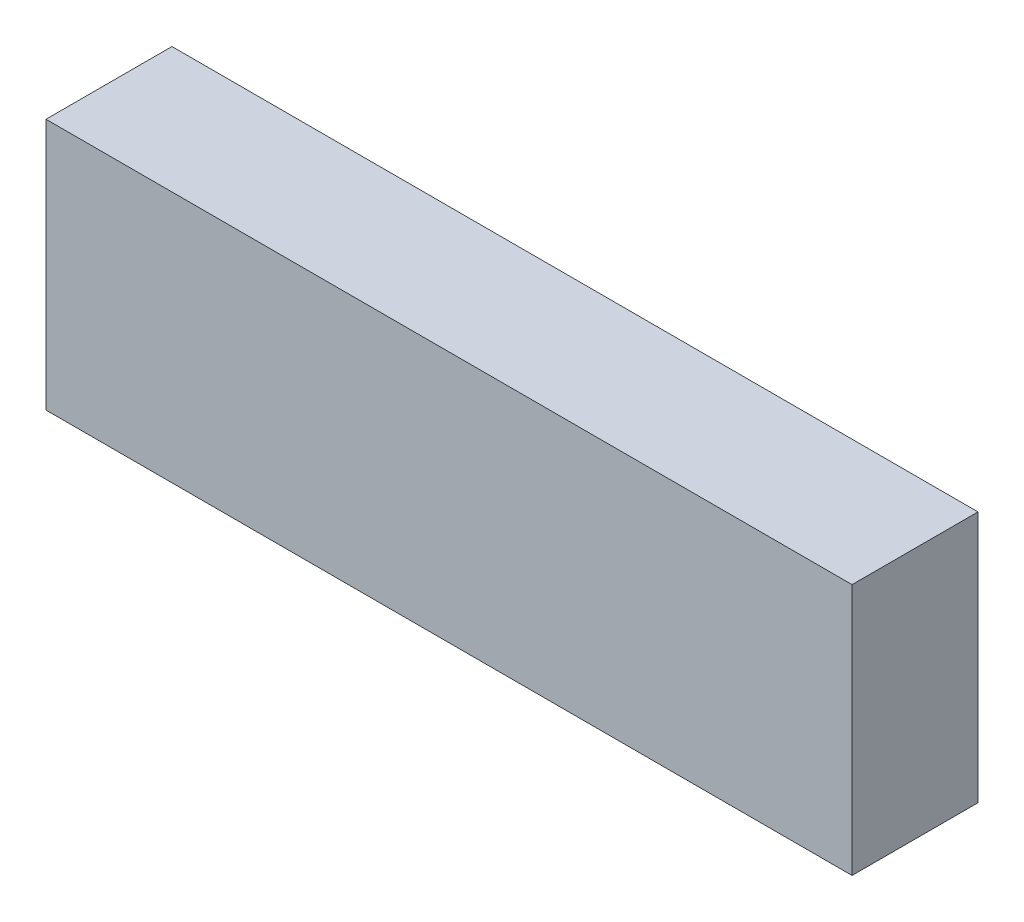
ISO-10303-21;
HEADER;
FILE_DESCRIPTION(('STEP AP214'),'2;1');
FILE_NAME('part.step','',(''),(''),'','','');
FILE_SCHEMA(('AUTOMOTIVE_DESIGN { 1 0 10303 214 1 1 1 1 }'));
ENDSEC;
DATA;
#1=APPLICATION_CONTEXT('core data for automotive mechanical design processes');
#2=APPLICATION_PROTOCOL_DEFINITION('international standard','automotive_design',2000,#1);
#3=PRODUCT_CONTEXT('',#1,'mechanical');
#4=PRODUCT('Part','Part','',(#3));
#5=PRODUCT_RELATED_PRODUCT_CATEGORY('part','',(#4));
#6=PRODUCT_DEFINITION_FORMATION('','',#4);
#7=PRODUCT_DEFINITION_CONTEXT('part definition',#1,'design');
#8=PRODUCT_DEFINITION('design','',#6,#7);
#9=PRODUCT_DEFINITION_SHAPE('','',#8);
#10=(LENGTH_UNIT() NAMED_UNIT(*) SI_UNIT(.MILLI.,.METRE.));
#11=(NAMED_UNIT(*) PLANE_ANGLE_UNIT() SI_UNIT($,.RADIAN.));
#12=(NAMED_UNIT(*) SI_UNIT($,.STERADIAN.) SOLID_ANGLE_UNIT());
#13=UNCERTAINTY_MEASURE_WITH_UNIT(LENGTH_MEASURE(1.E-05),#10,'distance_accuracy_value','');
#14=(GEOMETRIC_REPRESENTATION_CONTEXT(3) GLOBAL_UNCERTAINTY_ASSIGNED_CONTEXT((#13)) GLOBAL_UNIT_ASSIGNED_CONTEXT((#10,
#11,#12)) REPRESENTATION_CONTEXT('',''));
#15=CARTESIAN_POINT('',(0.,0.,0.));
#16=DIRECTION('',(0.,0.,1.));
#17=DIRECTION('',(1.,0.,0.));
#18=AXIS2_PLACEMENT_3D('',#15,#16,#17);
#19=CARTESIAN_POINT('',(0.,0.,25.));
#20=DIRECTION('',(1.,0.,0.));
#21=DIRECTION('',(0.,0.,-1.));
#22=AXIS2_PLACEMENT_3D('',#19,#20,#21);
#23=PLANE('',#22);
#24=DIRECTION('',(0.,-1.,0.));
#25=VECTOR('',#24,1.);
#26=CARTESIAN_POINT('',(0.,0.,0.));
#27=LINE('',#26,#25);
#28=CARTESIAN_POINT('',(0.,50.,0.));
#29=VERTEX_POINT('',#28);
#30=CARTESIAN_POINT('',(0.,0.,0.));
#31=VERTEX_POINT('',#30);
#32=EDGE_CURVE('E99',#29,#31,#27,.T.);
#33=ORIENTED_EDGE('',*,*,#32,.T.);
#34=DIRECTION('',(0.,0.,-1.));
#35=VECTOR('',#34,1.);
#36=CARTESIAN_POINT('',(0.,0.,25.));
#37=LINE('',#36,#35);
#38=CARTESIAN_POINT('',(0.,0.,25.));
#39=VERTEX_POINT('',#38);
#40=EDGE_CURVE('E11',#39,#31,#37,.T.);
#41=ORIENTED_EDGE('',*,*,#40,.F.);
#42=DIRECTION('',(0.,-1.,0.));
#43=VECTOR('',#42,1.);
#44=CARTESIAN_POINT('',(0.,0.,25.));
#45=LINE('',#44,#43);
#46=CARTESIAN_POINT('',(0.,50.,25.));
#47=VERTEX_POINT('',#46);
#48=EDGE_CURVE('E87',#47,#39,#45,.T.);
#49=ORIENTED_EDGE('',*,*,#48,.F.);
#50=DIRECTION('',(0.,0.,-1.));
#51=VECTOR('',#50,1.);
#52=CARTESIAN_POINT('',(0.,50.,25.));
#53=LINE('',#52,#51);
#54=EDGE_CURVE('E95',#47,#29,#53,.T.);
#55=ORIENTED_EDGE('',*,*,#54,.T.);
#56=EDGE_LOOP('',(#33,#41,#49,#55));
#57=FACE_BOUND('',#56,.T.);
#58=ADVANCED_FACE('F36',(#57),#23,.F.);
#59=CARTESIAN_POINT('',(0.,0.,25.));
#60=DIRECTION('',(0.,1.,0.));
#61=DIRECTION('',(0.,0.,1.));
#62=AXIS2_PLACEMENT_3D('',#59,#60,#61);
#63=PLANE('',#62);
#64=DIRECTION('',(1.,0.,0.));
#65=VECTOR('',#64,1.);
#66=CARTESIAN_POINT('',(0.,0.,0.));
#67=LINE('',#66,#65);
#68=CARTESIAN_POINT('',(160.,0.,0.));
#69=VERTEX_POINT('',#68);
#70=EDGE_CURVE('E91',#31,#69,#67,.T.);
#71=ORIENTED_EDGE('',*,*,#70,.T.);
#72=DIRECTION('',(0.,0.,-1.));
#73=VECTOR('',#72,1.);
#74=CARTESIAN_POINT('',(160.,0.,25.));
#75=LINE('',#74,#73);
#76=CARTESIAN_POINT('',(160.,0.,25.));
#77=VERTEX_POINT('',#76);
#78=EDGE_CURVE('E44',#77,#69,#75,.T.);
#79=ORIENTED_EDGE('',*,*,#78,.F.);
#80=DIRECTION('',(1.,0.,0.));
#81=VECTOR('',#80,1.);
#82=CARTESIAN_POINT('',(0.,0.,25.));
#83=LINE('',#82,#81);
#84=EDGE_CURVE('E82',#39,#77,#83,.T.);
#85=ORIENTED_EDGE('',*,*,#84,.F.);
#86=ORIENTED_EDGE('',*,*,#40,.T.);
#87=EDGE_LOOP('',(#71,#79,#85,#86));
#88=FACE_BOUND('',#87,.T.);
#89=ADVANCED_FACE('F90',(#88),#63,.F.);
#90=CARTESIAN_POINT('',(160.,0.,25.));
#91=DIRECTION('',(-1.,0.,0.));
#92=DIRECTION('',(0.,0.,1.));
#93=AXIS2_PLACEMENT_3D('',#90,#91,#92);
#94=PLANE('',#93);
#95=DIRECTION('',(0.,1.,0.));
#96=VECTOR('',#95,1.);
#97=CARTESIAN_POINT('',(160.,0.,0.));
#98=LINE('',#97,#96);
#99=CARTESIAN_POINT('',(160.,50.,0.));
#100=VERTEX_POINT('',#99);
#101=EDGE_CURVE('E69',#69,#100,#98,.T.);
#102=ORIENTED_EDGE('',*,*,#101,.T.);
#103=DIRECTION('',(0.,0.,-1.));
#104=VECTOR('',#103,1.);
#105=CARTESIAN_POINT('',(160.,50.,25.));
#106=LINE('',#105,#104);
#107=CARTESIAN_POINT('',(160.,50.,25.));
#108=VERTEX_POINT('',#107);
#109=EDGE_CURVE('E92',#108,#100,#106,.T.);
#110=ORIENTED_EDGE('',*,*,#109,.F.);
#111=DIRECTION('',(0.,1.,0.));
#112=VECTOR('',#111,1.);
#113=CARTESIAN_POINT('',(160.,0.,25.));
#114=LINE('',#113,#112);
#115=EDGE_CURVE('E85',#77,#108,#114,.T.);
#116=ORIENTED_EDGE('',*,*,#115,.F.);
#117=ORIENTED_EDGE('',*,*,#78,.T.);
#118=EDGE_LOOP('',(#102,#110,#116,#117));
#119=FACE_BOUND('',#118,.T.);
#120=ADVANCED_FACE('F93',(#119),#94,.F.);
#121=CARTESIAN_POINT('',(0.,50.,25.));
#122=DIRECTION('',(0.,-1.,0.));
#123=DIRECTION('',(0.,0.,-1.));
#124=AXIS2_PLACEMENT_3D('',#121,#122,#123);
#125=PLANE('',#124);
#126=DIRECTION('',(-1.,0.,0.));
#127=VECTOR('',#126,1.);
#128=CARTESIAN_POINT('',(0.,50.,0.));
#129=LINE('',#128,#127);
#130=EDGE_CURVE('E75',#100,#29,#129,.T.);
#131=ORIENTED_EDGE('',*,*,#130,.T.);
#132=ORIENTED_EDGE('',*,*,#54,.F.);
#133=DIRECTION('',(-1.,0.,0.));
#134=VECTOR('',#133,1.);
#135=CARTESIAN_POINT('',(0.,50.,25.));
#136=LINE('',#135,#134);
#137=EDGE_CURVE('E52',#108,#47,#136,.T.);
#138=ORIENTED_EDGE('',*,*,#137,.F.);
#139=ORIENTED_EDGE('',*,*,#109,.T.);
#140=EDGE_LOOP('',(#131,#132,#138,#139));
#141=FACE_BOUND('',#140,.T.);
#142=ADVANCED_FACE('F106',(#141),#125,.F.);
#143=CARTESIAN_POINT('',(0.,0.,25.));
#144=DIRECTION('',(0.,0.,-1.));
#145=DIRECTION('',(-1.,0.,0.));
#146=AXIS2_PLACEMENT_3D('',#143,#144,#145);
#147=PLANE('',#146);
#148=ORIENTED_EDGE('',*,*,#48,.T.);
#149=ORIENTED_EDGE('',*,*,#84,.T.);
#150=ORIENTED_EDGE('',*,*,#115,.T.);
#151=ORIENTED_EDGE('',*,*,#137,.T.);
#152=EDGE_LOOP('',(#148,#149,#150,#151));
#153=FACE_BOUND('',#152,.T.);
#154=ADVANCED_FACE('F83',(#153),#147,.F.);
#155=CARTESIAN_POINT('',(0.,0.,0.));
#156=DIRECTION('',(0.,0.,-1.));
#157=DIRECTION('',(-1.,0.,0.));
#158=AXIS2_PLACEMENT_3D('',#155,#156,#157);
#159=PLANE('',#158);
#160=ORIENTED_EDGE('',*,*,#32,.F.);
#161=ORIENTED_EDGE('',*,*,#130,.F.);
#162=ORIENTED_EDGE('',*,*,#101,.F.);
#163=ORIENTED_EDGE('',*,*,#70,.F.);
#164=EDGE_LOOP('',(#160,#161,#162,#163));
#165=FACE_BOUND('',#164,.T.);
#166=ADVANCED_FACE('F109',(#165),#159,.T.);
#167=CLOSED_SHELL('',(#58,#89,#120,#142,#154,#166));
#168=MANIFOLD_SOLID_BREP('B2',#167);
#169=ADVANCED_BREP_SHAPE_REPRESENTATION('',(#18,#168),#14);
#170=SHAPE_DEFINITION_REPRESENTATION(#9,#169);
ENDSEC;
END-ISO-10303-21;
